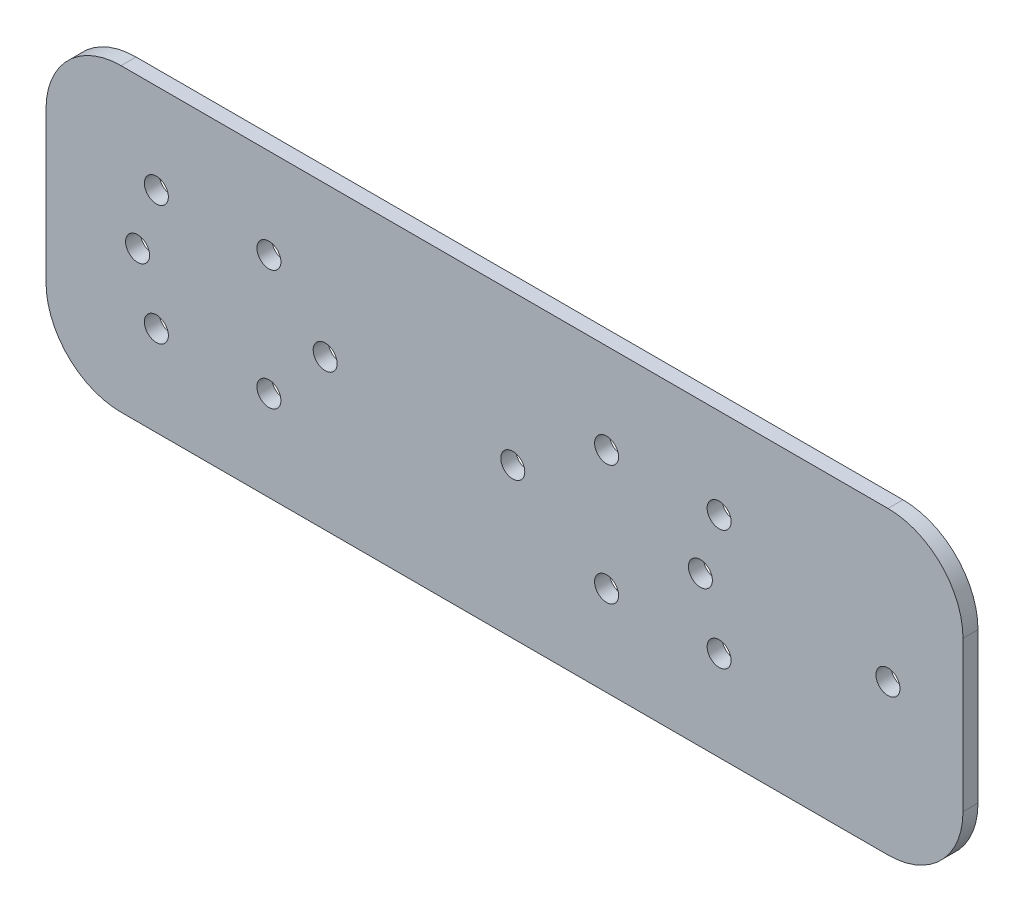
ISO-10303-21;
HEADER;
FILE_DESCRIPTION(('STEP AP214'),'2;1');
FILE_NAME('part.step','',(''),(''),'','','');
FILE_SCHEMA(('AUTOMOTIVE_DESIGN { 1 0 10303 214 1 1 1 1 }'));
ENDSEC;
DATA;
#1=APPLICATION_CONTEXT('core data for automotive mechanical design processes');
#2=APPLICATION_PROTOCOL_DEFINITION('international standard','automotive_design',2000,#1);
#3=PRODUCT_CONTEXT('',#1,'mechanical');
#4=PRODUCT('Part','Part','',(#3));
#5=PRODUCT_RELATED_PRODUCT_CATEGORY('part','',(#4));
#6=PRODUCT_DEFINITION_FORMATION('','',#4);
#7=PRODUCT_DEFINITION_CONTEXT('part definition',#1,'design');
#8=PRODUCT_DEFINITION('design','',#6,#7);
#9=PRODUCT_DEFINITION_SHAPE('','',#8);
#10=(LENGTH_UNIT() NAMED_UNIT(*) SI_UNIT(.MILLI.,.METRE.));
#11=(NAMED_UNIT(*) PLANE_ANGLE_UNIT() SI_UNIT($,.RADIAN.));
#12=(NAMED_UNIT(*) SI_UNIT($,.STERADIAN.) SOLID_ANGLE_UNIT());
#13=UNCERTAINTY_MEASURE_WITH_UNIT(LENGTH_MEASURE(1.E-05),#10,'distance_accuracy_value','');
#14=(GEOMETRIC_REPRESENTATION_CONTEXT(3) GLOBAL_UNCERTAINTY_ASSIGNED_CONTEXT((#13)) GLOBAL_UNIT_ASSIGNED_CONTEXT((#10,
#11,#12)) REPRESENTATION_CONTEXT('',''));
#15=CARTESIAN_POINT('',(0.,0.,0.));
#16=DIRECTION('',(0.,0.,1.));
#17=DIRECTION('',(1.,0.,0.));
#18=AXIS2_PLACEMENT_3D('',#15,#16,#17);
#19=CARTESIAN_POINT('',(0.,0.,2.));
#20=DIRECTION('',(0.,0.,-1.));
#21=DIRECTION('',(-1.,0.,0.));
#22=AXIS2_PLACEMENT_3D('',#19,#20,#21);
#23=PLANE('',#22);
#24=DIRECTION('',(-1.,0.,0.));
#25=VECTOR('',#24,1.);
#26=CARTESIAN_POINT('',(-70.,20.,2.));
#27=LINE('',#26,#25);
#28=CARTESIAN_POINT('',(60.,20.,2.));
#29=VERTEX_POINT('',#28);
#30=CARTESIAN_POINT('',(-42.2067583870634,20.,2.));
#31=VERTEX_POINT('',#30);
#32=EDGE_CURVE('E175',#29,#31,#27,.T.);
#33=ORIENTED_EDGE('',*,*,#32,.T.);
#34=CARTESIAN_POINT('',(-42.2067583870634,10.,2.));
#35=DIRECTION('',(0.,0.,-1.));
#36=DIRECTION('',(-1.,0.,0.));
#37=AXIS2_PLACEMENT_3D('',#34,#35,#36);
#38=CIRCLE('',#37,10.);
#39=CARTESIAN_POINT('',(-52.2067583870634,10.,2.));
#40=VERTEX_POINT('',#39);
#41=EDGE_CURVE('E152',#31,#40,#38,.F.);
#42=ORIENTED_EDGE('',*,*,#41,.T.);
#43=DIRECTION('',(0.,1.,0.));
#44=VECTOR('',#43,1.);
#45=CARTESIAN_POINT('',(-52.2067583870634,20.,2.));
#46=LINE('',#45,#44);
#47=CARTESIAN_POINT('',(-52.2067583870634,-9.99999999999999,2.));
#48=VERTEX_POINT('',#47);
#49=EDGE_CURVE('E174',#48,#40,#46,.T.);
#50=ORIENTED_EDGE('',*,*,#49,.F.);
#51=CARTESIAN_POINT('',(-42.2067583870634,-9.99999999999999,2.));
#52=DIRECTION('',(0.,0.,-1.));
#53=DIRECTION('',(-1.,0.,0.));
#54=AXIS2_PLACEMENT_3D('',#51,#52,#53);
#55=CIRCLE('',#54,10.);
#56=CARTESIAN_POINT('',(-42.2067583870634,-20.,2.));
#57=VERTEX_POINT('',#56);
#58=EDGE_CURVE('E150',#48,#57,#55,.F.);
#59=ORIENTED_EDGE('',*,*,#58,.T.);
#60=DIRECTION('',(1.,0.,0.));
#61=VECTOR('',#60,1.);
#62=CARTESIAN_POINT('',(-70.,-20.,2.));
#63=LINE('',#62,#61);
#64=CARTESIAN_POINT('',(60.,-20.,2.));
#65=VERTEX_POINT('',#64);
#66=EDGE_CURVE('E133',#57,#65,#63,.T.);
#67=ORIENTED_EDGE('',*,*,#66,.T.);
#68=CARTESIAN_POINT('',(60.,-10.,2.));
#69=DIRECTION('',(0.,0.,-1.));
#70=DIRECTION('',(-1.,0.,0.));
#71=AXIS2_PLACEMENT_3D('',#68,#69,#70);
#72=CIRCLE('',#71,10.);
#73=CARTESIAN_POINT('',(70.,-10.,2.));
#74=VERTEX_POINT('',#73);
#75=EDGE_CURVE('E142',#65,#74,#72,.F.);
#76=ORIENTED_EDGE('',*,*,#75,.T.);
#77=DIRECTION('',(0.,1.,0.));
#78=VECTOR('',#77,1.);
#79=CARTESIAN_POINT('',(70.,-20.,2.));
#80=LINE('',#79,#78);
#81=CARTESIAN_POINT('',(70.,10.,2.));
#82=VERTEX_POINT('',#81);
#83=EDGE_CURVE('E117',#74,#82,#80,.T.);
#84=ORIENTED_EDGE('',*,*,#83,.T.);
#85=CARTESIAN_POINT('',(60.,10.,2.));
#86=DIRECTION('',(0.,0.,-1.));
#87=DIRECTION('',(-1.,0.,0.));
#88=AXIS2_PLACEMENT_3D('',#85,#86,#87);
#89=CIRCLE('',#88,10.);
#90=EDGE_CURVE('E140',#82,#29,#89,.F.);
#91=ORIENTED_EDGE('',*,*,#90,.T.);
#92=EDGE_LOOP('',(#33,#42,#50,#59,#67,#76,#84,#91));
#93=FACE_BOUND('',#92,.T.);
#94=CARTESIAN_POINT('',(60.,3.49148133884313E-13,2.));
#95=DIRECTION('',(0.,0.,1.));
#96=DIRECTION('',(1.,0.,0.));
#97=AXIS2_PLACEMENT_3D('',#94,#95,#96);
#98=CIRCLE('',#97,1.6);
#99=CARTESIAN_POINT('',(61.6,3.49148133884313E-13,2.));
#100=VERTEX_POINT('',#99);
#101=EDGE_CURVE('E124',#100,#100,#98,.T.);
#102=ORIENTED_EDGE('',*,*,#101,.F.);
#103=EDGE_LOOP('',(#102));
#104=FACE_BOUND('',#103,.T.);
#105=CARTESIAN_POINT('',(35.,1.74574066942157E-13,2.));
#106=DIRECTION('',(0.,0.,1.));
#107=DIRECTION('',(1.,0.,0.));
#108=AXIS2_PLACEMENT_3D('',#105,#106,#107);
#109=CIRCLE('',#108,1.6);
#110=CARTESIAN_POINT('',(36.6,1.74574066942157E-13,2.));
#111=VERTEX_POINT('',#110);
#112=EDGE_CURVE('E249',#111,#111,#109,.T.);
#113=ORIENTED_EDGE('',*,*,#112,.F.);
#114=EDGE_LOOP('',(#113));
#115=FACE_BOUND('',#114,.T.);
#116=CARTESIAN_POINT('',(10.,0.,2.));
#117=DIRECTION('',(0.,0.,1.));
#118=DIRECTION('',(1.,0.,0.));
#119=AXIS2_PLACEMENT_3D('',#116,#117,#118);
#120=CIRCLE('',#119,1.6);
#121=CARTESIAN_POINT('',(11.6,0.,2.));
#122=VERTEX_POINT('',#121);
#123=EDGE_CURVE('E243',#122,#122,#120,.T.);
#124=ORIENTED_EDGE('',*,*,#123,.F.);
#125=EDGE_LOOP('',(#124));
#126=FACE_BOUND('',#125,.T.);
#127=CARTESIAN_POINT('',(-15.,-1.74574066942157E-13,2.));
#128=DIRECTION('',(0.,0.,1.));
#129=DIRECTION('',(1.,0.,0.));
#130=AXIS2_PLACEMENT_3D('',#127,#128,#129);
#131=CIRCLE('',#130,1.6);
#132=CARTESIAN_POINT('',(-13.4,-1.74574066942157E-13,2.));
#133=VERTEX_POINT('',#132);
#134=EDGE_CURVE('E237',#133,#133,#131,.T.);
#135=ORIENTED_EDGE('',*,*,#134,.F.);
#136=EDGE_LOOP('',(#135));
#137=FACE_BOUND('',#136,.T.);
#138=CARTESIAN_POINT('',(-40.,-3.49148133884313E-13,2.));
#139=DIRECTION('',(0.,0.,1.));
#140=DIRECTION('',(1.,0.,0.));
#141=AXIS2_PLACEMENT_3D('',#138,#139,#140);
#142=CIRCLE('',#141,1.60000000000001);
#143=CARTESIAN_POINT('',(-38.4,-3.49148133884313E-13,2.));
#144=VERTEX_POINT('',#143);
#145=EDGE_CURVE('E231',#144,#144,#142,.T.);
#146=ORIENTED_EDGE('',*,*,#145,.F.);
#147=EDGE_LOOP('',(#146));
#148=FACE_BOUND('',#147,.T.);
#149=CARTESIAN_POINT('',(37.5,8.,2.));
#150=DIRECTION('',(0.,0.,1.));
#151=DIRECTION('',(1.,0.,0.));
#152=AXIS2_PLACEMENT_3D('',#149,#150,#151);
#153=CIRCLE('',#152,1.6);
#154=CARTESIAN_POINT('',(39.1,8.,2.));
#155=VERTEX_POINT('',#154);
#156=EDGE_CURVE('E225',#155,#155,#153,.T.);
#157=ORIENTED_EDGE('',*,*,#156,.F.);
#158=EDGE_LOOP('',(#157));
#159=FACE_BOUND('',#158,.T.);
#160=CARTESIAN_POINT('',(37.5,-8.,2.));
#161=DIRECTION('',(0.,0.,1.));
#162=DIRECTION('',(-1.,0.,0.));
#163=AXIS2_PLACEMENT_3D('',#160,#161,#162);
#164=CIRCLE('',#163,1.6);
#165=CARTESIAN_POINT('',(35.9,-8.,2.));
#166=VERTEX_POINT('',#165);
#167=EDGE_CURVE('E219',#166,#166,#164,.T.);
#168=ORIENTED_EDGE('',*,*,#167,.F.);
#169=EDGE_LOOP('',(#168));
#170=FACE_BOUND('',#169,.T.);
#171=CARTESIAN_POINT('',(22.5,-8.,2.));
#172=DIRECTION('',(0.,0.,1.));
#173=DIRECTION('',(1.,0.,0.));
#174=AXIS2_PLACEMENT_3D('',#171,#172,#173);
#175=CIRCLE('',#174,1.6);
#176=CARTESIAN_POINT('',(24.1,-8.,2.));
#177=VERTEX_POINT('',#176);
#178=EDGE_CURVE('E213',#177,#177,#175,.T.);
#179=ORIENTED_EDGE('',*,*,#178,.F.);
#180=EDGE_LOOP('',(#179));
#181=FACE_BOUND('',#180,.T.);
#182=CARTESIAN_POINT('',(22.5,8.,2.));
#183=DIRECTION('',(0.,0.,1.));
#184=DIRECTION('',(-1.,0.,0.));
#185=AXIS2_PLACEMENT_3D('',#182,#183,#184);
#186=CIRCLE('',#185,1.6);
#187=CARTESIAN_POINT('',(20.9,8.,2.));
#188=VERTEX_POINT('',#187);
#189=EDGE_CURVE('E207',#188,#188,#186,.T.);
#190=ORIENTED_EDGE('',*,*,#189,.F.);
#191=EDGE_LOOP('',(#190));
#192=FACE_BOUND('',#191,.T.);
#193=CARTESIAN_POINT('',(-22.5,-8.00000000000001,2.));
#194=DIRECTION('',(0.,0.,1.));
#195=DIRECTION('',(-1.,0.,0.));
#196=AXIS2_PLACEMENT_3D('',#193,#194,#195);
#197=CIRCLE('',#196,1.6);
#198=CARTESIAN_POINT('',(-24.1,-8.00000000000001,2.));
#199=VERTEX_POINT('',#198);
#200=EDGE_CURVE('E201',#199,#199,#197,.T.);
#201=ORIENTED_EDGE('',*,*,#200,.F.);
#202=EDGE_LOOP('',(#201));
#203=FACE_BOUND('',#202,.T.);
#204=CARTESIAN_POINT('',(-37.5,-8.00000000000001,2.));
#205=DIRECTION('',(0.,0.,1.));
#206=DIRECTION('',(1.,0.,0.));
#207=AXIS2_PLACEMENT_3D('',#204,#205,#206);
#208=CIRCLE('',#207,1.6);
#209=CARTESIAN_POINT('',(-35.9,-8.00000000000001,2.));
#210=VERTEX_POINT('',#209);
#211=EDGE_CURVE('E195',#210,#210,#208,.T.);
#212=ORIENTED_EDGE('',*,*,#211,.F.);
#213=EDGE_LOOP('',(#212));
#214=FACE_BOUND('',#213,.T.);
#215=CARTESIAN_POINT('',(-22.5,7.99999999999999,2.));
#216=DIRECTION('',(0.,0.,1.));
#217=DIRECTION('',(1.,0.,0.));
#218=AXIS2_PLACEMENT_3D('',#215,#216,#217);
#219=CIRCLE('',#218,1.6);
#220=CARTESIAN_POINT('',(-20.9,7.99999999999999,2.));
#221=VERTEX_POINT('',#220);
#222=EDGE_CURVE('E189',#221,#221,#219,.T.);
#223=ORIENTED_EDGE('',*,*,#222,.F.);
#224=EDGE_LOOP('',(#223));
#225=FACE_BOUND('',#224,.T.);
#226=CARTESIAN_POINT('',(-37.5,7.99999999999999,2.));
#227=DIRECTION('',(0.,0.,1.));
#228=DIRECTION('',(-1.,0.,0.));
#229=AXIS2_PLACEMENT_3D('',#226,#227,#228);
#230=CIRCLE('',#229,1.6);
#231=CARTESIAN_POINT('',(-39.1,7.99999999999999,2.));
#232=VERTEX_POINT('',#231);
#233=EDGE_CURVE('E183',#232,#232,#230,.T.);
#234=ORIENTED_EDGE('',*,*,#233,.F.);
#235=EDGE_LOOP('',(#234));
#236=FACE_BOUND('',#235,.T.);
#237=ADVANCED_FACE('F34',(#93,#104,#115,#126,#137,#148,#159,#170,#181,#192,#203,#214,#225,#236),
#23,.F.);
#238=CARTESIAN_POINT('',(0.,0.,0.));
#239=DIRECTION('',(0.,0.,-1.));
#240=DIRECTION('',(-1.,0.,0.));
#241=AXIS2_PLACEMENT_3D('',#238,#239,#240);
#242=PLANE('',#241);
#243=DIRECTION('',(0.,-1.,0.));
#244=VECTOR('',#243,1.);
#245=CARTESIAN_POINT('',(-52.2067583870634,0.,0.));
#246=LINE('',#245,#244);
#247=CARTESIAN_POINT('',(-52.2067583870634,10.,0.));
#248=VERTEX_POINT('',#247);
#249=CARTESIAN_POINT('',(-52.2067583870634,-10.,0.));
#250=VERTEX_POINT('',#249);
#251=EDGE_CURVE('E160',#248,#250,#246,.T.);
#252=ORIENTED_EDGE('',*,*,#251,.F.);
#253=CARTESIAN_POINT('',(-42.2067583870634,10.,0.));
#254=DIRECTION('',(0.,0.,-1.));
#255=DIRECTION('',(-1.,0.,0.));
#256=AXIS2_PLACEMENT_3D('',#253,#254,#255);
#257=CIRCLE('',#256,10.);
#258=CARTESIAN_POINT('',(-42.2067583870634,20.,0.));
#259=VERTEX_POINT('',#258);
#260=EDGE_CURVE('E42',#248,#259,#257,.T.);
#261=ORIENTED_EDGE('',*,*,#260,.T.);
#262=DIRECTION('',(-1.,0.,0.));
#263=VECTOR('',#262,1.);
#264=CARTESIAN_POINT('',(-70.,20.,0.));
#265=LINE('',#264,#263);
#266=CARTESIAN_POINT('',(60.,20.,0.));
#267=VERTEX_POINT('',#266);
#268=EDGE_CURVE('E123',#267,#259,#265,.T.);
#269=ORIENTED_EDGE('',*,*,#268,.F.);
#270=CARTESIAN_POINT('',(60.,10.,0.));
#271=DIRECTION('',(0.,0.,-1.));
#272=DIRECTION('',(-1.,0.,0.));
#273=AXIS2_PLACEMENT_3D('',#270,#271,#272);
#274=CIRCLE('',#273,10.);
#275=CARTESIAN_POINT('',(70.,10.,0.));
#276=VERTEX_POINT('',#275);
#277=EDGE_CURVE('E108',#267,#276,#274,.T.);
#278=ORIENTED_EDGE('',*,*,#277,.T.);
#279=DIRECTION('',(0.,1.,0.));
#280=VECTOR('',#279,1.);
#281=CARTESIAN_POINT('',(70.,-20.,0.));
#282=LINE('',#281,#280);
#283=CARTESIAN_POINT('',(70.,-10.,0.));
#284=VERTEX_POINT('',#283);
#285=EDGE_CURVE('E114',#284,#276,#282,.T.);
#286=ORIENTED_EDGE('',*,*,#285,.F.);
#287=CARTESIAN_POINT('',(60.,-10.,0.));
#288=DIRECTION('',(0.,0.,-1.));
#289=DIRECTION('',(-1.,0.,0.));
#290=AXIS2_PLACEMENT_3D('',#287,#288,#289);
#291=CIRCLE('',#290,10.);
#292=CARTESIAN_POINT('',(60.,-20.,0.));
#293=VERTEX_POINT('',#292);
#294=EDGE_CURVE('E100',#284,#293,#291,.T.);
#295=ORIENTED_EDGE('',*,*,#294,.T.);
#296=DIRECTION('',(1.,0.,0.));
#297=VECTOR('',#296,1.);
#298=CARTESIAN_POINT('',(-70.,-20.,0.));
#299=LINE('',#298,#297);
#300=CARTESIAN_POINT('',(-42.2067583870634,-20.,0.));
#301=VERTEX_POINT('',#300);
#302=EDGE_CURVE('E127',#301,#293,#299,.T.);
#303=ORIENTED_EDGE('',*,*,#302,.F.);
#304=CARTESIAN_POINT('',(-42.2067583870634,-9.99999999999999,0.));
#305=DIRECTION('',(0.,0.,-1.));
#306=DIRECTION('',(-1.,0.,0.));
#307=AXIS2_PLACEMENT_3D('',#304,#305,#306);
#308=CIRCLE('',#307,10.);
#309=EDGE_CURVE('E54',#301,#250,#308,.T.);
#310=ORIENTED_EDGE('',*,*,#309,.T.);
#311=EDGE_LOOP('',(#252,#261,#269,#278,#286,#295,#303,#310));
#312=FACE_BOUND('',#311,.T.);
#313=CARTESIAN_POINT('',(-22.5,7.99999999999999,0.));
#314=DIRECTION('',(0.,0.,1.));
#315=DIRECTION('',(1.,0.,0.));
#316=AXIS2_PLACEMENT_3D('',#313,#314,#315);
#317=CIRCLE('',#316,1.6);
#318=CARTESIAN_POINT('',(-20.9,7.99999999999999,0.));
#319=VERTEX_POINT('',#318);
#320=EDGE_CURVE('E186',#319,#319,#317,.T.);
#321=ORIENTED_EDGE('',*,*,#320,.T.);
#322=EDGE_LOOP('',(#321));
#323=FACE_BOUND('',#322,.T.);
#324=CARTESIAN_POINT('',(-22.5,-8.00000000000001,0.));
#325=DIRECTION('',(0.,0.,1.));
#326=DIRECTION('',(-1.,0.,0.));
#327=AXIS2_PLACEMENT_3D('',#324,#325,#326);
#328=CIRCLE('',#327,1.6);
#329=CARTESIAN_POINT('',(-24.1,-8.00000000000001,0.));
#330=VERTEX_POINT('',#329);
#331=EDGE_CURVE('E198',#330,#330,#328,.T.);
#332=ORIENTED_EDGE('',*,*,#331,.T.);
#333=EDGE_LOOP('',(#332));
#334=FACE_BOUND('',#333,.T.);
#335=CARTESIAN_POINT('',(22.5,-8.,0.));
#336=DIRECTION('',(0.,0.,1.));
#337=DIRECTION('',(1.,0.,0.));
#338=AXIS2_PLACEMENT_3D('',#335,#336,#337);
#339=CIRCLE('',#338,1.6);
#340=CARTESIAN_POINT('',(24.1,-8.,0.));
#341=VERTEX_POINT('',#340);
#342=EDGE_CURVE('E210',#341,#341,#339,.T.);
#343=ORIENTED_EDGE('',*,*,#342,.T.);
#344=EDGE_LOOP('',(#343));
#345=FACE_BOUND('',#344,.T.);
#346=CARTESIAN_POINT('',(37.5,8.,0.));
#347=DIRECTION('',(0.,0.,1.));
#348=DIRECTION('',(1.,0.,0.));
#349=AXIS2_PLACEMENT_3D('',#346,#347,#348);
#350=CIRCLE('',#349,1.6);
#351=CARTESIAN_POINT('',(39.1,8.,0.));
#352=VERTEX_POINT('',#351);
#353=EDGE_CURVE('E222',#352,#352,#350,.T.);
#354=ORIENTED_EDGE('',*,*,#353,.T.);
#355=EDGE_LOOP('',(#354));
#356=FACE_BOUND('',#355,.T.);
#357=CARTESIAN_POINT('',(-15.,-1.74574066942157E-13,0.));
#358=DIRECTION('',(0.,0.,1.));
#359=DIRECTION('',(1.,0.,0.));
#360=AXIS2_PLACEMENT_3D('',#357,#358,#359);
#361=CIRCLE('',#360,1.6);
#362=CARTESIAN_POINT('',(-13.4,-1.74574066942157E-13,0.));
#363=VERTEX_POINT('',#362);
#364=EDGE_CURVE('E234',#363,#363,#361,.T.);
#365=ORIENTED_EDGE('',*,*,#364,.T.);
#366=EDGE_LOOP('',(#365));
#367=FACE_BOUND('',#366,.T.);
#368=CARTESIAN_POINT('',(35.,1.74574066942157E-13,0.));
#369=DIRECTION('',(0.,0.,1.));
#370=DIRECTION('',(1.,0.,0.));
#371=AXIS2_PLACEMENT_3D('',#368,#369,#370);
#372=CIRCLE('',#371,1.6);
#373=CARTESIAN_POINT('',(36.6,1.74574066942157E-13,0.));
#374=VERTEX_POINT('',#373);
#375=EDGE_CURVE('E246',#374,#374,#372,.T.);
#376=ORIENTED_EDGE('',*,*,#375,.T.);
#377=EDGE_LOOP('',(#376));
#378=FACE_BOUND('',#377,.T.);
#379=CARTESIAN_POINT('',(60.,3.49148133884313E-13,0.));
#380=DIRECTION('',(0.,0.,1.));
#381=DIRECTION('',(1.,0.,0.));
#382=AXIS2_PLACEMENT_3D('',#379,#380,#381);
#383=CIRCLE('',#382,1.6);
#384=CARTESIAN_POINT('',(61.6,3.49148133884313E-13,0.));
#385=VERTEX_POINT('',#384);
#386=EDGE_CURVE('E130',#385,#385,#383,.T.);
#387=ORIENTED_EDGE('',*,*,#386,.T.);
#388=EDGE_LOOP('',(#387));
#389=FACE_BOUND('',#388,.T.);
#390=CARTESIAN_POINT('',(10.,0.,0.));
#391=DIRECTION('',(0.,0.,1.));
#392=DIRECTION('',(1.,0.,0.));
#393=AXIS2_PLACEMENT_3D('',#390,#391,#392);
#394=CIRCLE('',#393,1.6);
#395=CARTESIAN_POINT('',(11.6,0.,0.));
#396=VERTEX_POINT('',#395);
#397=EDGE_CURVE('E240',#396,#396,#394,.T.);
#398=ORIENTED_EDGE('',*,*,#397,.T.);
#399=EDGE_LOOP('',(#398));
#400=FACE_BOUND('',#399,.T.);
#401=CARTESIAN_POINT('',(-40.,-3.49148133884313E-13,0.));
#402=DIRECTION('',(0.,0.,1.));
#403=DIRECTION('',(1.,0.,0.));
#404=AXIS2_PLACEMENT_3D('',#401,#402,#403);
#405=CIRCLE('',#404,1.60000000000001);
#406=CARTESIAN_POINT('',(-38.4,-3.49148133884313E-13,0.));
#407=VERTEX_POINT('',#406);
#408=EDGE_CURVE('E228',#407,#407,#405,.T.);
#409=ORIENTED_EDGE('',*,*,#408,.T.);
#410=EDGE_LOOP('',(#409));
#411=FACE_BOUND('',#410,.T.);
#412=CARTESIAN_POINT('',(37.5,-8.,0.));
#413=DIRECTION('',(0.,0.,1.));
#414=DIRECTION('',(-1.,0.,0.));
#415=AXIS2_PLACEMENT_3D('',#412,#413,#414);
#416=CIRCLE('',#415,1.6);
#417=CARTESIAN_POINT('',(35.9,-8.,0.));
#418=VERTEX_POINT('',#417);
#419=EDGE_CURVE('E216',#418,#418,#416,.T.);
#420=ORIENTED_EDGE('',*,*,#419,.T.);
#421=EDGE_LOOP('',(#420));
#422=FACE_BOUND('',#421,.T.);
#423=CARTESIAN_POINT('',(22.5,8.,0.));
#424=DIRECTION('',(0.,0.,1.));
#425=DIRECTION('',(-1.,0.,0.));
#426=AXIS2_PLACEMENT_3D('',#423,#424,#425);
#427=CIRCLE('',#426,1.6);
#428=CARTESIAN_POINT('',(20.9,8.,0.));
#429=VERTEX_POINT('',#428);
#430=EDGE_CURVE('E204',#429,#429,#427,.T.);
#431=ORIENTED_EDGE('',*,*,#430,.T.);
#432=EDGE_LOOP('',(#431));
#433=FACE_BOUND('',#432,.T.);
#434=CARTESIAN_POINT('',(-37.5,-8.00000000000001,0.));
#435=DIRECTION('',(0.,0.,1.));
#436=DIRECTION('',(1.,0.,0.));
#437=AXIS2_PLACEMENT_3D('',#434,#435,#436);
#438=CIRCLE('',#437,1.6);
#439=CARTESIAN_POINT('',(-35.9,-8.00000000000001,0.));
#440=VERTEX_POINT('',#439);
#441=EDGE_CURVE('E192',#440,#440,#438,.T.);
#442=ORIENTED_EDGE('',*,*,#441,.T.);
#443=EDGE_LOOP('',(#442));
#444=FACE_BOUND('',#443,.T.);
#445=CARTESIAN_POINT('',(-37.5,7.99999999999999,0.));
#446=DIRECTION('',(0.,0.,1.));
#447=DIRECTION('',(-1.,0.,0.));
#448=AXIS2_PLACEMENT_3D('',#445,#446,#447);
#449=CIRCLE('',#448,1.6);
#450=CARTESIAN_POINT('',(-39.1,7.99999999999999,0.));
#451=VERTEX_POINT('',#450);
#452=EDGE_CURVE('E180',#451,#451,#449,.T.);
#453=ORIENTED_EDGE('',*,*,#452,.T.);
#454=EDGE_LOOP('',(#453));
#455=FACE_BOUND('',#454,.T.);
#456=ADVANCED_FACE('F120',(#312,#323,#334,#345,#356,#367,#378,#389,#400,#411,#422,#433,#444,
#455),#242,.T.);
#457=CARTESIAN_POINT('',(70.,-20.,2.));
#458=DIRECTION('',(-1.,0.,0.));
#459=DIRECTION('',(0.,0.,1.));
#460=AXIS2_PLACEMENT_3D('',#457,#458,#459);
#461=PLANE('',#460);
#462=ORIENTED_EDGE('',*,*,#83,.F.);
#463=DIRECTION('',(0.,0.,-1.));
#464=VECTOR('',#463,1.);
#465=CARTESIAN_POINT('',(70.,-10.,2.));
#466=LINE('',#465,#464);
#467=EDGE_CURVE('E104',#74,#284,#466,.T.);
#468=ORIENTED_EDGE('',*,*,#467,.T.);
#469=ORIENTED_EDGE('',*,*,#285,.T.);
#470=DIRECTION('',(0.,0.,-1.));
#471=VECTOR('',#470,1.);
#472=CARTESIAN_POINT('',(70.,10.,2.));
#473=LINE('',#472,#471);
#474=EDGE_CURVE('E118',#276,#82,#473,.F.);
#475=ORIENTED_EDGE('',*,*,#474,.T.);
#476=EDGE_LOOP('',(#462,#468,#469,#475));
#477=FACE_BOUND('',#476,.T.);
#478=ADVANCED_FACE('F113',(#477),#461,.F.);
#479=CARTESIAN_POINT('',(-70.,20.,2.));
#480=DIRECTION('',(0.,-1.,0.));
#481=DIRECTION('',(0.,0.,-1.));
#482=AXIS2_PLACEMENT_3D('',#479,#480,#481);
#483=PLANE('',#482);
#484=ORIENTED_EDGE('',*,*,#268,.T.);
#485=DIRECTION('',(0.,0.,1.));
#486=VECTOR('',#485,1.);
#487=CARTESIAN_POINT('',(-42.2067583870634,20.,2.));
#488=LINE('',#487,#486);
#489=EDGE_CURVE('E147',#259,#31,#488,.T.);
#490=ORIENTED_EDGE('',*,*,#489,.T.);
#491=ORIENTED_EDGE('',*,*,#32,.F.);
#492=DIRECTION('',(0.,0.,-1.));
#493=VECTOR('',#492,1.);
#494=CARTESIAN_POINT('',(60.,20.,2.));
#495=LINE('',#494,#493);
#496=EDGE_CURVE('E144',#29,#267,#495,.T.);
#497=ORIENTED_EDGE('',*,*,#496,.T.);
#498=EDGE_LOOP('',(#484,#490,#491,#497));
#499=FACE_BOUND('',#498,.T.);
#500=ADVANCED_FACE('F165',(#499),#483,.F.);
#501=CARTESIAN_POINT('',(-70.,-20.,2.));
#502=DIRECTION('',(0.,1.,0.));
#503=DIRECTION('',(0.,0.,1.));
#504=AXIS2_PLACEMENT_3D('',#501,#502,#503);
#505=PLANE('',#504);
#506=ORIENTED_EDGE('',*,*,#66,.F.);
#507=DIRECTION('',(0.,0.,1.));
#508=VECTOR('',#507,1.);
#509=CARTESIAN_POINT('',(-42.2067583870634,-20.,2.));
#510=LINE('',#509,#508);
#511=EDGE_CURVE('E11',#57,#301,#510,.F.);
#512=ORIENTED_EDGE('',*,*,#511,.T.);
#513=ORIENTED_EDGE('',*,*,#302,.T.);
#514=DIRECTION('',(0.,0.,-1.));
#515=VECTOR('',#514,1.);
#516=CARTESIAN_POINT('',(60.,-20.,2.));
#517=LINE('',#516,#515);
#518=EDGE_CURVE('E106',#293,#65,#517,.F.);
#519=ORIENTED_EDGE('',*,*,#518,.T.);
#520=EDGE_LOOP('',(#506,#512,#513,#519));
#521=FACE_BOUND('',#520,.T.);
#522=ADVANCED_FACE('F256',(#521),#505,.F.);
#523=CARTESIAN_POINT('',(60.,3.49148133884313E-13,2.));
#524=DIRECTION('',(0.,0.,-1.));
#525=DIRECTION('',(-1.,0.,0.));
#526=AXIS2_PLACEMENT_3D('',#523,#524,#525);
#527=CYLINDRICAL_SURFACE('',#526,1.6);
#528=ORIENTED_EDGE('',*,*,#101,.T.);
#529=EDGE_LOOP('',(#528));
#530=FACE_BOUND('',#529,.T.);
#531=ORIENTED_EDGE('',*,*,#386,.F.);
#532=EDGE_LOOP('',(#531));
#533=FACE_BOUND('',#532,.T.);
#534=ADVANCED_FACE('F269',(#530,#533),#527,.F.);
#535=CARTESIAN_POINT('',(35.,1.74574066942157E-13,2.));
#536=DIRECTION('',(0.,0.,-1.));
#537=DIRECTION('',(-1.,0.,0.));
#538=AXIS2_PLACEMENT_3D('',#535,#536,#537);
#539=CYLINDRICAL_SURFACE('',#538,1.6);
#540=ORIENTED_EDGE('',*,*,#112,.T.);
#541=EDGE_LOOP('',(#540));
#542=FACE_BOUND('',#541,.T.);
#543=ORIENTED_EDGE('',*,*,#375,.F.);
#544=EDGE_LOOP('',(#543));
#545=FACE_BOUND('',#544,.T.);
#546=ADVANCED_FACE('F333',(#542,#545),#539,.F.);
#547=CARTESIAN_POINT('',(10.,0.,2.));
#548=DIRECTION('',(0.,0.,-1.));
#549=DIRECTION('',(-1.,0.,0.));
#550=AXIS2_PLACEMENT_3D('',#547,#548,#549);
#551=CYLINDRICAL_SURFACE('',#550,1.6);
#552=ORIENTED_EDGE('',*,*,#123,.T.);
#553=EDGE_LOOP('',(#552));
#554=FACE_BOUND('',#553,.T.);
#555=ORIENTED_EDGE('',*,*,#397,.F.);
#556=EDGE_LOOP('',(#555));
#557=FACE_BOUND('',#556,.T.);
#558=ADVANCED_FACE('F330',(#554,#557),#551,.F.);
#559=CARTESIAN_POINT('',(-15.,-1.74574066942157E-13,2.));
#560=DIRECTION('',(0.,0.,-1.));
#561=DIRECTION('',(-1.,0.,0.));
#562=AXIS2_PLACEMENT_3D('',#559,#560,#561);
#563=CYLINDRICAL_SURFACE('',#562,1.6);
#564=ORIENTED_EDGE('',*,*,#134,.T.);
#565=EDGE_LOOP('',(#564));
#566=FACE_BOUND('',#565,.T.);
#567=ORIENTED_EDGE('',*,*,#364,.F.);
#568=EDGE_LOOP('',(#567));
#569=FACE_BOUND('',#568,.T.);
#570=ADVANCED_FACE('F326',(#566,#569),#563,.F.);
#571=CARTESIAN_POINT('',(-40.,-3.49148133884313E-13,2.));
#572=DIRECTION('',(0.,0.,-1.));
#573=DIRECTION('',(-1.,0.,0.));
#574=AXIS2_PLACEMENT_3D('',#571,#572,#573);
#575=CYLINDRICAL_SURFACE('',#574,1.60000000000001);
#576=ORIENTED_EDGE('',*,*,#145,.T.);
#577=EDGE_LOOP('',(#576));
#578=FACE_BOUND('',#577,.T.);
#579=ORIENTED_EDGE('',*,*,#408,.F.);
#580=EDGE_LOOP('',(#579));
#581=FACE_BOUND('',#580,.T.);
#582=ADVANCED_FACE('F322',(#578,#581),#575,.F.);
#583=CARTESIAN_POINT('',(37.5,8.,2.));
#584=DIRECTION('',(0.,0.,-1.));
#585=DIRECTION('',(-1.,0.,0.));
#586=AXIS2_PLACEMENT_3D('',#583,#584,#585);
#587=CYLINDRICAL_SURFACE('',#586,1.6);
#588=ORIENTED_EDGE('',*,*,#156,.T.);
#589=EDGE_LOOP('',(#588));
#590=FACE_BOUND('',#589,.T.);
#591=ORIENTED_EDGE('',*,*,#353,.F.);
#592=EDGE_LOOP('',(#591));
#593=FACE_BOUND('',#592,.T.);
#594=ADVANCED_FACE('F318',(#590,#593),#587,.F.);
#595=CARTESIAN_POINT('',(37.5,-8.,2.));
#596=DIRECTION('',(0.,0.,-1.));
#597=DIRECTION('',(-1.,0.,0.));
#598=AXIS2_PLACEMENT_3D('',#595,#596,#597);
#599=CYLINDRICAL_SURFACE('',#598,1.6);
#600=ORIENTED_EDGE('',*,*,#167,.T.);
#601=EDGE_LOOP('',(#600));
#602=FACE_BOUND('',#601,.T.);
#603=ORIENTED_EDGE('',*,*,#419,.F.);
#604=EDGE_LOOP('',(#603));
#605=FACE_BOUND('',#604,.T.);
#606=ADVANCED_FACE('F314',(#602,#605),#599,.F.);
#607=CARTESIAN_POINT('',(22.5,-8.,2.));
#608=DIRECTION('',(0.,0.,-1.));
#609=DIRECTION('',(-1.,0.,0.));
#610=AXIS2_PLACEMENT_3D('',#607,#608,#609);
#611=CYLINDRICAL_SURFACE('',#610,1.6);
#612=ORIENTED_EDGE('',*,*,#178,.T.);
#613=EDGE_LOOP('',(#612));
#614=FACE_BOUND('',#613,.T.);
#615=ORIENTED_EDGE('',*,*,#342,.F.);
#616=EDGE_LOOP('',(#615));
#617=FACE_BOUND('',#616,.T.);
#618=ADVANCED_FACE('F310',(#614,#617),#611,.F.);
#619=CARTESIAN_POINT('',(22.5,8.,2.));
#620=DIRECTION('',(0.,0.,-1.));
#621=DIRECTION('',(-1.,0.,0.));
#622=AXIS2_PLACEMENT_3D('',#619,#620,#621);
#623=CYLINDRICAL_SURFACE('',#622,1.6);
#624=ORIENTED_EDGE('',*,*,#189,.T.);
#625=EDGE_LOOP('',(#624));
#626=FACE_BOUND('',#625,.T.);
#627=ORIENTED_EDGE('',*,*,#430,.F.);
#628=EDGE_LOOP('',(#627));
#629=FACE_BOUND('',#628,.T.);
#630=ADVANCED_FACE('F306',(#626,#629),#623,.F.);
#631=CARTESIAN_POINT('',(-22.5,-8.00000000000001,2.));
#632=DIRECTION('',(0.,0.,-1.));
#633=DIRECTION('',(-1.,0.,0.));
#634=AXIS2_PLACEMENT_3D('',#631,#632,#633);
#635=CYLINDRICAL_SURFACE('',#634,1.6);
#636=ORIENTED_EDGE('',*,*,#200,.T.);
#637=EDGE_LOOP('',(#636));
#638=FACE_BOUND('',#637,.T.);
#639=ORIENTED_EDGE('',*,*,#331,.F.);
#640=EDGE_LOOP('',(#639));
#641=FACE_BOUND('',#640,.T.);
#642=ADVANCED_FACE('F302',(#638,#641),#635,.F.);
#643=CARTESIAN_POINT('',(-37.5,-8.00000000000001,2.));
#644=DIRECTION('',(0.,0.,-1.));
#645=DIRECTION('',(-1.,0.,0.));
#646=AXIS2_PLACEMENT_3D('',#643,#644,#645);
#647=CYLINDRICAL_SURFACE('',#646,1.6);
#648=ORIENTED_EDGE('',*,*,#211,.T.);
#649=EDGE_LOOP('',(#648));
#650=FACE_BOUND('',#649,.T.);
#651=ORIENTED_EDGE('',*,*,#441,.F.);
#652=EDGE_LOOP('',(#651));
#653=FACE_BOUND('',#652,.T.);
#654=ADVANCED_FACE('F298',(#650,#653),#647,.F.);
#655=CARTESIAN_POINT('',(-22.5,7.99999999999999,2.));
#656=DIRECTION('',(0.,0.,-1.));
#657=DIRECTION('',(-1.,0.,0.));
#658=AXIS2_PLACEMENT_3D('',#655,#656,#657);
#659=CYLINDRICAL_SURFACE('',#658,1.6);
#660=ORIENTED_EDGE('',*,*,#222,.T.);
#661=EDGE_LOOP('',(#660));
#662=FACE_BOUND('',#661,.T.);
#663=ORIENTED_EDGE('',*,*,#320,.F.);
#664=EDGE_LOOP('',(#663));
#665=FACE_BOUND('',#664,.T.);
#666=ADVANCED_FACE('F294',(#662,#665),#659,.F.);
#667=CARTESIAN_POINT('',(-37.5,7.99999999999999,2.));
#668=DIRECTION('',(0.,0.,-1.));
#669=DIRECTION('',(-1.,0.,0.));
#670=AXIS2_PLACEMENT_3D('',#667,#668,#669);
#671=CYLINDRICAL_SURFACE('',#670,1.6);
#672=ORIENTED_EDGE('',*,*,#233,.T.);
#673=EDGE_LOOP('',(#672));
#674=FACE_BOUND('',#673,.T.);
#675=ORIENTED_EDGE('',*,*,#452,.F.);
#676=EDGE_LOOP('',(#675));
#677=FACE_BOUND('',#676,.T.);
#678=ADVANCED_FACE('F281',(#674,#677),#671,.F.);
#679=CARTESIAN_POINT('',(60.,-10.,2.));
#680=DIRECTION('',(0.,0.,-1.));
#681=DIRECTION('',(-1.,0.,0.));
#682=AXIS2_PLACEMENT_3D('',#679,#680,#681);
#683=CYLINDRICAL_SURFACE('',#682,10.);
#684=ORIENTED_EDGE('',*,*,#75,.F.);
#685=ORIENTED_EDGE('',*,*,#518,.F.);
#686=ORIENTED_EDGE('',*,*,#294,.F.);
#687=ORIENTED_EDGE('',*,*,#467,.F.);
#688=EDGE_LOOP('',(#684,#685,#686,#687));
#689=FACE_BOUND('',#688,.T.);
#690=ADVANCED_FACE('F103',(#689),#683,.T.);
#691=CARTESIAN_POINT('',(60.,10.,2.));
#692=DIRECTION('',(0.,0.,-1.));
#693=DIRECTION('',(-1.,0.,0.));
#694=AXIS2_PLACEMENT_3D('',#691,#692,#693);
#695=CYLINDRICAL_SURFACE('',#694,10.);
#696=ORIENTED_EDGE('',*,*,#90,.F.);
#697=ORIENTED_EDGE('',*,*,#474,.F.);
#698=ORIENTED_EDGE('',*,*,#277,.F.);
#699=ORIENTED_EDGE('',*,*,#496,.F.);
#700=EDGE_LOOP('',(#696,#697,#698,#699));
#701=FACE_BOUND('',#700,.T.);
#702=ADVANCED_FACE('F280',(#701),#695,.T.);
#703=CARTESIAN_POINT('',(-52.2067583870634,20.,-8.));
#704=DIRECTION('',(1.,0.,0.));
#705=DIRECTION('',(0.,1.,0.));
#706=AXIS2_PLACEMENT_3D('',#703,#704,#705);
#707=PLANE('',#706);
#708=ORIENTED_EDGE('',*,*,#49,.T.);
#709=DIRECTION('',(0.,0.,1.));
#710=VECTOR('',#709,1.);
#711=CARTESIAN_POINT('',(-52.2067583870634,10.,-8.));
#712=LINE('',#711,#710);
#713=EDGE_CURVE('E157',#40,#248,#712,.F.);
#714=ORIENTED_EDGE('',*,*,#713,.T.);
#715=ORIENTED_EDGE('',*,*,#251,.T.);
#716=DIRECTION('',(0.,0.,1.));
#717=VECTOR('',#716,1.);
#718=CARTESIAN_POINT('',(-52.2067583870634,-9.99999999999999,-8.));
#719=LINE('',#718,#717);
#720=EDGE_CURVE('E154',#250,#48,#719,.T.);
#721=ORIENTED_EDGE('',*,*,#720,.T.);
#722=EDGE_LOOP('',(#708,#714,#715,#721));
#723=FACE_BOUND('',#722,.T.);
#724=ADVANCED_FACE('F177',(#723),#707,.F.);
#725=CARTESIAN_POINT('',(-42.2067583870634,10.,2.));
#726=DIRECTION('',(0.,0.,1.));
#727=DIRECTION('',(1.,0.,0.));
#728=AXIS2_PLACEMENT_3D('',#725,#726,#727);
#729=CYLINDRICAL_SURFACE('',#728,10.);
#730=ORIENTED_EDGE('',*,*,#260,.F.);
#731=ORIENTED_EDGE('',*,*,#713,.F.);
#732=ORIENTED_EDGE('',*,*,#41,.F.);
#733=ORIENTED_EDGE('',*,*,#489,.F.);
#734=EDGE_LOOP('',(#730,#731,#732,#733));
#735=FACE_BOUND('',#734,.T.);
#736=ADVANCED_FACE('F169',(#735),#729,.T.);
#737=CARTESIAN_POINT('',(-42.2067583870634,-9.99999999999999,-8.));
#738=DIRECTION('',(0.,0.,1.));
#739=DIRECTION('',(1.,0.,0.));
#740=AXIS2_PLACEMENT_3D('',#737,#738,#739);
#741=CYLINDRICAL_SURFACE('',#740,10.);
#742=ORIENTED_EDGE('',*,*,#309,.F.);
#743=ORIENTED_EDGE('',*,*,#511,.F.);
#744=ORIENTED_EDGE('',*,*,#58,.F.);
#745=ORIENTED_EDGE('',*,*,#720,.F.);
#746=EDGE_LOOP('',(#742,#743,#744,#745));
#747=FACE_BOUND('',#746,.T.);
#748=ADVANCED_FACE('F36',(#747),#741,.T.);
#749=CLOSED_SHELL('',(#237,#456,#478,#500,#522,#534,#546,#558,#570,#582,#594,#606,#618,#630,
#642,#654,#666,#678,#690,#702,#724,#736,#748));
#750=MANIFOLD_SOLID_BREP('B2',#749);
#751=ADVANCED_BREP_SHAPE_REPRESENTATION('',(#18,#750),#14);
#752=SHAPE_DEFINITION_REPRESENTATION(#9,#751);
ENDSEC;
END-ISO-10303-21;
